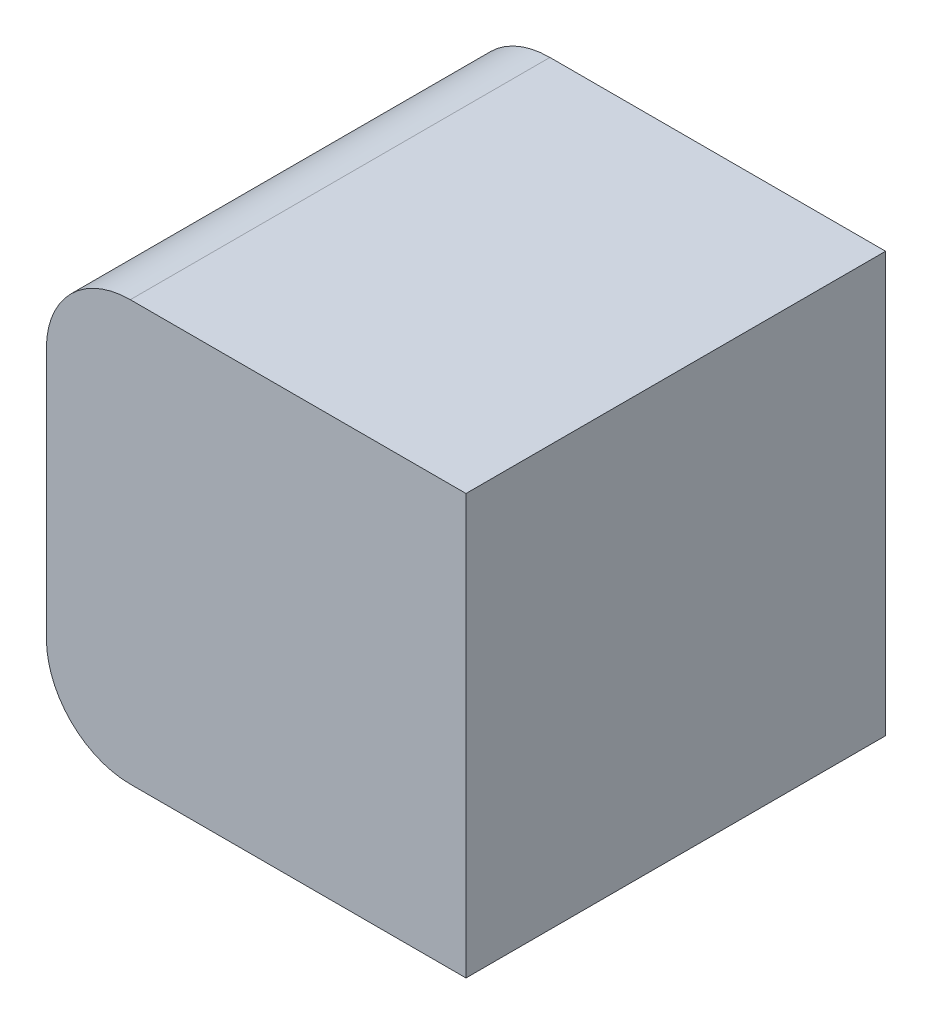
ISO-10303-21;
HEADER;
FILE_DESCRIPTION(('STEP AP214'),'2;1');
FILE_NAME('part.step','',(''),(''),'','','');
FILE_SCHEMA(('AUTOMOTIVE_DESIGN { 1 0 10303 214 1 1 1 1 }'));
ENDSEC;
DATA;
#1=APPLICATION_CONTEXT('core data for automotive mechanical design processes');
#2=APPLICATION_PROTOCOL_DEFINITION('international standard','automotive_design',2000,#1);
#3=PRODUCT_CONTEXT('',#1,'mechanical');
#4=PRODUCT('Part','Part','',(#3));
#5=PRODUCT_RELATED_PRODUCT_CATEGORY('part','',(#4));
#6=PRODUCT_DEFINITION_FORMATION('','',#4);
#7=PRODUCT_DEFINITION_CONTEXT('part definition',#1,'design');
#8=PRODUCT_DEFINITION('design','',#6,#7);
#9=PRODUCT_DEFINITION_SHAPE('','',#8);
#10=(LENGTH_UNIT() NAMED_UNIT(*) SI_UNIT(.MILLI.,.METRE.));
#11=(NAMED_UNIT(*) PLANE_ANGLE_UNIT() SI_UNIT($,.RADIAN.));
#12=(NAMED_UNIT(*) SI_UNIT($,.STERADIAN.) SOLID_ANGLE_UNIT());
#13=UNCERTAINTY_MEASURE_WITH_UNIT(LENGTH_MEASURE(1.E-05),#10,'distance_accuracy_value','');
#14=(GEOMETRIC_REPRESENTATION_CONTEXT(3) GLOBAL_UNCERTAINTY_ASSIGNED_CONTEXT((#13)) GLOBAL_UNIT_ASSIGNED_CONTEXT((#10,
#11,#12)) REPRESENTATION_CONTEXT('',''));
#15=CARTESIAN_POINT('',(0.,0.,0.));
#16=DIRECTION('',(0.,0.,1.));
#17=DIRECTION('',(1.,0.,0.));
#18=AXIS2_PLACEMENT_3D('',#15,#16,#17);
#19=CARTESIAN_POINT('',(1000.,0.,-1000.));
#20=DIRECTION('',(0.,1.,0.));
#21=DIRECTION('',(0.,0.,1.));
#22=AXIS2_PLACEMENT_3D('',#19,#20,#21);
#23=PLANE('',#22);
#24=DIRECTION('',(-1.,0.,0.));
#25=VECTOR('',#24,1.);
#26=CARTESIAN_POINT('',(1000.,0.,0.));
#27=LINE('',#26,#25);
#28=CARTESIAN_POINT('',(1000.,0.,0.));
#29=VERTEX_POINT('',#28);
#30=CARTESIAN_POINT('',(200.,0.,0.));
#31=VERTEX_POINT('',#30);
#32=EDGE_CURVE('E158',#29,#31,#27,.T.);
#33=ORIENTED_EDGE('',*,*,#32,.T.);
#34=DIRECTION('',(0.,0.,-1.));
#35=VECTOR('',#34,1.);
#36=CARTESIAN_POINT('',(200.,0.,-1000.));
#37=LINE('',#36,#35);
#38=CARTESIAN_POINT('',(200.,0.,-1000.));
#39=VERTEX_POINT('',#38);
#40=EDGE_CURVE('E11',#31,#39,#37,.T.);
#41=ORIENTED_EDGE('',*,*,#40,.T.);
#42=DIRECTION('',(-1.,0.,0.));
#43=VECTOR('',#42,1.);
#44=CARTESIAN_POINT('',(1000.,0.,-1000.));
#45=LINE('',#44,#43);
#46=CARTESIAN_POINT('',(1000.,0.,-1000.));
#47=VERTEX_POINT('',#46);
#48=EDGE_CURVE('E104',#47,#39,#45,.T.);
#49=ORIENTED_EDGE('',*,*,#48,.F.);
#50=DIRECTION('',(0.,0.,-1.));
#51=VECTOR('',#50,1.);
#52=CARTESIAN_POINT('',(1000.,0.,-1000.));
#53=LINE('',#52,#51);
#54=EDGE_CURVE('E110',#29,#47,#53,.T.);
#55=ORIENTED_EDGE('',*,*,#54,.F.);
#56=EDGE_LOOP('',(#33,#41,#49,#55));
#57=FACE_BOUND('',#56,.T.);
#58=ADVANCED_FACE('F45',(#57),#23,.F.);
#59=CARTESIAN_POINT('',(1000.,1000.,-1000.));
#60=DIRECTION('',(0.,0.,1.));
#61=DIRECTION('',(0.,-1.,0.));
#62=AXIS2_PLACEMENT_3D('',#59,#60,#61);
#63=PLANE('',#62);
#64=DIRECTION('',(0.,1.,0.));
#65=VECTOR('',#64,1.);
#66=CARTESIAN_POINT('',(0.,1000.,-1000.));
#67=LINE('',#66,#65);
#68=CARTESIAN_POINT('',(0.,200.,-1000.));
#69=VERTEX_POINT('',#68);
#70=CARTESIAN_POINT('',(0.,800.,-1000.));
#71=VERTEX_POINT('',#70);
#72=EDGE_CURVE('E132',#69,#71,#67,.T.);
#73=ORIENTED_EDGE('',*,*,#72,.T.);
#74=CARTESIAN_POINT('',(200.,800.,-1000.));
#75=DIRECTION('',(0.,0.,1.));
#76=DIRECTION('',(0.,-1.,0.));
#77=AXIS2_PLACEMENT_3D('',#74,#75,#76);
#78=CIRCLE('',#77,200.);
#79=CARTESIAN_POINT('',(200.,1000.,-1000.));
#80=VERTEX_POINT('',#79);
#81=EDGE_CURVE('E53',#71,#80,#78,.F.);
#82=ORIENTED_EDGE('',*,*,#81,.T.);
#83=DIRECTION('',(-1.,0.,0.));
#84=VECTOR('',#83,1.);
#85=CARTESIAN_POINT('',(1000.,1000.,-1000.));
#86=LINE('',#85,#84);
#87=CARTESIAN_POINT('',(1000.,1000.,-1000.));
#88=VERTEX_POINT('',#87);
#89=EDGE_CURVE('E106',#88,#80,#86,.T.);
#90=ORIENTED_EDGE('',*,*,#89,.F.);
#91=DIRECTION('',(0.,1.,0.));
#92=VECTOR('',#91,1.);
#93=CARTESIAN_POINT('',(1000.,1000.,-1000.));
#94=LINE('',#93,#92);
#95=EDGE_CURVE('E100',#47,#88,#94,.T.);
#96=ORIENTED_EDGE('',*,*,#95,.F.);
#97=ORIENTED_EDGE('',*,*,#48,.T.);
#98=CARTESIAN_POINT('',(200.,200.,-1000.));
#99=DIRECTION('',(0.,0.,1.));
#100=DIRECTION('',(0.,-1.,0.));
#101=AXIS2_PLACEMENT_3D('',#98,#99,#100);
#102=CIRCLE('',#101,200.);
#103=EDGE_CURVE('E60',#39,#69,#102,.F.);
#104=ORIENTED_EDGE('',*,*,#103,.T.);
#105=EDGE_LOOP('',(#73,#82,#90,#96,#97,#104));
#106=FACE_BOUND('',#105,.T.);
#107=ADVANCED_FACE('F102',(#106),#63,.F.);
#108=CARTESIAN_POINT('',(1000.,1000.,0.));
#109=DIRECTION('',(0.,-1.,0.));
#110=DIRECTION('',(0.,0.,-1.));
#111=AXIS2_PLACEMENT_3D('',#108,#109,#110);
#112=PLANE('',#111);
#113=ORIENTED_EDGE('',*,*,#89,.T.);
#114=DIRECTION('',(0.,0.,1.));
#115=VECTOR('',#114,1.);
#116=CARTESIAN_POINT('',(200.,1000.,0.));
#117=LINE('',#116,#115);
#118=CARTESIAN_POINT('',(200.,1000.,0.));
#119=VERTEX_POINT('',#118);
#120=EDGE_CURVE('E121',#80,#119,#117,.T.);
#121=ORIENTED_EDGE('',*,*,#120,.T.);
#122=DIRECTION('',(-1.,0.,0.));
#123=VECTOR('',#122,1.);
#124=CARTESIAN_POINT('',(1000.,1000.,0.));
#125=LINE('',#124,#123);
#126=CARTESIAN_POINT('',(1000.,1000.,0.));
#127=VERTEX_POINT('',#126);
#128=EDGE_CURVE('E126',#127,#119,#125,.T.);
#129=ORIENTED_EDGE('',*,*,#128,.F.);
#130=DIRECTION('',(0.,0.,1.));
#131=VECTOR('',#130,1.);
#132=CARTESIAN_POINT('',(1000.,1000.,0.));
#133=LINE('',#132,#131);
#134=EDGE_CURVE('E109',#88,#127,#133,.T.);
#135=ORIENTED_EDGE('',*,*,#134,.F.);
#136=EDGE_LOOP('',(#113,#121,#129,#135));
#137=FACE_BOUND('',#136,.T.);
#138=ADVANCED_FACE('F145',(#137),#112,.F.);
#139=CARTESIAN_POINT('',(1000.,0.,0.));
#140=DIRECTION('',(0.,0.,-1.));
#141=DIRECTION('',(-1.,0.,0.));
#142=AXIS2_PLACEMENT_3D('',#139,#140,#141);
#143=PLANE('',#142);
#144=ORIENTED_EDGE('',*,*,#128,.T.);
#145=CARTESIAN_POINT('',(200.,800.,0.));
#146=DIRECTION('',(0.,0.,-1.));
#147=DIRECTION('',(-1.,0.,0.));
#148=AXIS2_PLACEMENT_3D('',#145,#146,#147);
#149=CIRCLE('',#148,200.);
#150=CARTESIAN_POINT('',(0.,800.,0.));
#151=VERTEX_POINT('',#150);
#152=EDGE_CURVE('E136',#119,#151,#149,.F.);
#153=ORIENTED_EDGE('',*,*,#152,.T.);
#154=DIRECTION('',(0.,-1.,0.));
#155=VECTOR('',#154,1.);
#156=CARTESIAN_POINT('',(0.,0.,0.));
#157=LINE('',#156,#155);
#158=CARTESIAN_POINT('',(0.,200.,0.));
#159=VERTEX_POINT('',#158);
#160=EDGE_CURVE('E119',#151,#159,#157,.T.);
#161=ORIENTED_EDGE('',*,*,#160,.T.);
#162=CARTESIAN_POINT('',(200.,200.,0.));
#163=DIRECTION('',(0.,0.,-1.));
#164=DIRECTION('',(-1.,0.,0.));
#165=AXIS2_PLACEMENT_3D('',#162,#163,#164);
#166=CIRCLE('',#165,200.);
#167=EDGE_CURVE('E124',#159,#31,#166,.F.);
#168=ORIENTED_EDGE('',*,*,#167,.T.);
#169=ORIENTED_EDGE('',*,*,#32,.F.);
#170=DIRECTION('',(0.,-1.,0.));
#171=VECTOR('',#170,1.);
#172=CARTESIAN_POINT('',(1000.,0.,0.));
#173=LINE('',#172,#171);
#174=EDGE_CURVE('E115',#127,#29,#173,.T.);
#175=ORIENTED_EDGE('',*,*,#174,.F.);
#176=EDGE_LOOP('',(#144,#153,#161,#168,#169,#175));
#177=FACE_BOUND('',#176,.T.);
#178=ADVANCED_FACE('F151',(#177),#143,.F.);
#179=CARTESIAN_POINT('',(1000.,0.,0.));
#180=DIRECTION('',(-1.,0.,0.));
#181=DIRECTION('',(0.,0.,1.));
#182=AXIS2_PLACEMENT_3D('',#179,#180,#181);
#183=PLANE('',#182);
#184=ORIENTED_EDGE('',*,*,#54,.T.);
#185=ORIENTED_EDGE('',*,*,#95,.T.);
#186=ORIENTED_EDGE('',*,*,#134,.T.);
#187=ORIENTED_EDGE('',*,*,#174,.T.);
#188=EDGE_LOOP('',(#184,#185,#186,#187));
#189=FACE_BOUND('',#188,.T.);
#190=ADVANCED_FACE('F113',(#189),#183,.F.);
#191=CARTESIAN_POINT('',(0.,0.,0.));
#192=DIRECTION('',(-1.,0.,0.));
#193=DIRECTION('',(0.,0.,1.));
#194=AXIS2_PLACEMENT_3D('',#191,#192,#193);
#195=PLANE('',#194);
#196=CARTESIAN_POINT('',(0.,500.,-500.));
#197=DIRECTION('',(1.,0.,0.));
#198=DIRECTION('',(0.,0.,-1.));
#199=AXIS2_PLACEMENT_3D('',#196,#197,#198);
#200=CIRCLE('',#199,250.);
#201=CARTESIAN_POINT('',(0.,500.,-750.));
#202=VERTEX_POINT('',#201);
#203=EDGE_CURVE('E133',#202,#202,#200,.T.);
#204=ORIENTED_EDGE('',*,*,#203,.T.);
#205=EDGE_LOOP('',(#204));
#206=FACE_BOUND('',#205,.T.);
#207=ORIENTED_EDGE('',*,*,#160,.F.);
#208=DIRECTION('',(0.,0.,1.));
#209=VECTOR('',#208,1.);
#210=CARTESIAN_POINT('',(0.,800.,-1000.));
#211=LINE('',#210,#209);
#212=EDGE_CURVE('E67',#151,#71,#211,.F.);
#213=ORIENTED_EDGE('',*,*,#212,.T.);
#214=ORIENTED_EDGE('',*,*,#72,.F.);
#215=DIRECTION('',(0.,0.,-1.));
#216=VECTOR('',#215,1.);
#217=CARTESIAN_POINT('',(0.,200.,0.));
#218=LINE('',#217,#216);
#219=EDGE_CURVE('E138',#69,#159,#218,.F.);
#220=ORIENTED_EDGE('',*,*,#219,.T.);
#221=EDGE_LOOP('',(#207,#213,#214,#220));
#222=FACE_BOUND('',#221,.T.);
#223=ADVANCED_FACE('F153',(#206,#222),#195,.T.);
#224=CARTESIAN_POINT('',(400.,500.,-500.));
#225=DIRECTION('',(-1.,0.,0.));
#226=DIRECTION('',(0.,0.,1.));
#227=AXIS2_PLACEMENT_3D('',#224,#225,#226);
#228=CYLINDRICAL_SURFACE('',#227,250.);
#229=CARTESIAN_POINT('',(166.50004165011,500.,-500.));
#230=DIRECTION('',(1.,0.,0.));
#231=DIRECTION('',(0.,0.,-1.));
#232=AXIS2_PLACEMENT_3D('',#229,#230,#231);
#233=CIRCLE('',#232,250.);
#234=CARTESIAN_POINT('',(166.50004165011,500.,-750.));
#235=VERTEX_POINT('',#234);
#236=EDGE_CURVE('E130',#235,#235,#233,.F.);
#237=ORIENTED_EDGE('',*,*,#236,.F.);
#238=EDGE_LOOP('',(#237));
#239=FACE_BOUND('',#238,.T.);
#240=ORIENTED_EDGE('',*,*,#203,.F.);
#241=EDGE_LOOP('',(#240));
#242=FACE_BOUND('',#241,.T.);
#243=ADVANCED_FACE('F165',(#239,#242),#228,.F.);
#244=CARTESIAN_POINT('',(500.,500.,-500.));
#245=DIRECTION('',(0.,0.,1.));
#246=DIRECTION('',(0.,1.,0.));
#247=AXIS2_PLACEMENT_3D('',#244,#245,#246);
#248=SPHERICAL_SURFACE('',#247,416.799978670079);
#249=CARTESIAN_POINT('',(500.,500.,-500.));
#250=DIRECTION('',(1.,0.,0.));
#251=DIRECTION('',(0.,0.,-1.));
#252=AXIS2_PLACEMENT_3D('',#249,#250,#251);
#253=SPHERICAL_SURFACE('',#252,416.799978670079);
#254=ORIENTED_EDGE('',*,*,#236,.T.);
#255=EDGE_LOOP('',(#254));
#256=FACE_BOUND('',#255,.T.);
#257=ADVANCED_FACE('F167',(#256),#253,.F.);
#258=CARTESIAN_POINT('',(200.,800.,0.));
#259=DIRECTION('',(0.,0.,-1.));
#260=DIRECTION('',(-1.,0.,0.));
#261=AXIS2_PLACEMENT_3D('',#258,#259,#260);
#262=CYLINDRICAL_SURFACE('',#261,200.);
#263=ORIENTED_EDGE('',*,*,#81,.F.);
#264=ORIENTED_EDGE('',*,*,#212,.F.);
#265=ORIENTED_EDGE('',*,*,#152,.F.);
#266=ORIENTED_EDGE('',*,*,#120,.F.);
#267=EDGE_LOOP('',(#263,#264,#265,#266));
#268=FACE_BOUND('',#267,.T.);
#269=ADVANCED_FACE('F148',(#268),#262,.T.);
#270=CARTESIAN_POINT('',(200.,200.,-1000.));
#271=DIRECTION('',(0.,0.,1.));
#272=DIRECTION('',(1.,0.,0.));
#273=AXIS2_PLACEMENT_3D('',#270,#271,#272);
#274=CYLINDRICAL_SURFACE('',#273,200.);
#275=ORIENTED_EDGE('',*,*,#167,.F.);
#276=ORIENTED_EDGE('',*,*,#219,.F.);
#277=ORIENTED_EDGE('',*,*,#103,.F.);
#278=ORIENTED_EDGE('',*,*,#40,.F.);
#279=EDGE_LOOP('',(#275,#276,#277,#278));
#280=FACE_BOUND('',#279,.T.);
#281=ADVANCED_FACE('F47',(#280),#274,.T.);
#282=CLOSED_SHELL('',(#58,#107,#138,#178,#190,#223,#243,#257,#269,#281));
#283=MANIFOLD_SOLID_BREP('B2',#282);
#284=ADVANCED_BREP_SHAPE_REPRESENTATION('',(#18,#283),#14);
#285=SHAPE_DEFINITION_REPRESENTATION(#9,#284);
ENDSEC;
END-ISO-10303-21;
